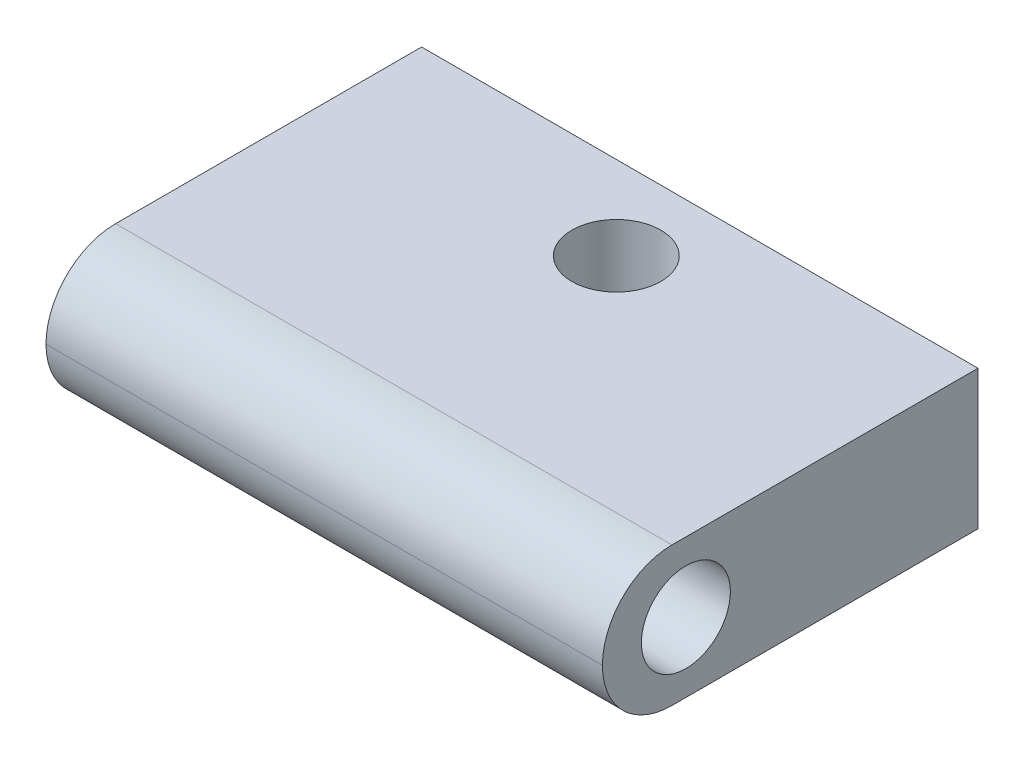
ISO-10303-21;
HEADER;
FILE_DESCRIPTION(('STEP AP214'),'2;1');
FILE_NAME('part.step','',(''),(''),'','','');
FILE_SCHEMA(('AUTOMOTIVE_DESIGN { 1 0 10303 214 1 1 1 1 }'));
ENDSEC;
DATA;
#1=APPLICATION_CONTEXT('core data for automotive mechanical design processes');
#2=APPLICATION_PROTOCOL_DEFINITION('international standard','automotive_design',2000,#1);
#3=PRODUCT_CONTEXT('',#1,'mechanical');
#4=PRODUCT('Part','Part','',(#3));
#5=PRODUCT_RELATED_PRODUCT_CATEGORY('part','',(#4));
#6=PRODUCT_DEFINITION_FORMATION('','',#4);
#7=PRODUCT_DEFINITION_CONTEXT('part definition',#1,'design');
#8=PRODUCT_DEFINITION('design','',#6,#7);
#9=PRODUCT_DEFINITION_SHAPE('','',#8);
#10=(LENGTH_UNIT() NAMED_UNIT(*) SI_UNIT(.MILLI.,.METRE.));
#11=(NAMED_UNIT(*) PLANE_ANGLE_UNIT() SI_UNIT($,.RADIAN.));
#12=(NAMED_UNIT(*) SI_UNIT($,.STERADIAN.) SOLID_ANGLE_UNIT());
#13=UNCERTAINTY_MEASURE_WITH_UNIT(LENGTH_MEASURE(1.E-05),#10,'distance_accuracy_value','');
#14=(GEOMETRIC_REPRESENTATION_CONTEXT(3) GLOBAL_UNCERTAINTY_ASSIGNED_CONTEXT((#13)) GLOBAL_UNIT_ASSIGNED_CONTEXT((#10,
#11,#12)) REPRESENTATION_CONTEXT('',''));
#15=CARTESIAN_POINT('',(0.,0.,0.));
#16=DIRECTION('',(0.,0.,1.));
#17=DIRECTION('',(1.,0.,0.));
#18=AXIS2_PLACEMENT_3D('',#15,#16,#17);
#19=CARTESIAN_POINT('',(10.,5.,-6.75));
#20=DIRECTION('',(0.,0.,1.));
#21=DIRECTION('',(1.,0.,0.));
#22=AXIS2_PLACEMENT_3D('',#19,#20,#21);
#23=PLANE('',#22);
#24=DIRECTION('',(-1.,0.,0.));
#25=VECTOR('',#24,1.);
#26=CARTESIAN_POINT('',(10.,0.,-6.75));
#27=LINE('',#26,#25);
#28=CARTESIAN_POINT('',(10.,0.,-6.75));
#29=VERTEX_POINT('',#28);
#30=CARTESIAN_POINT('',(-10.,0.,-6.75));
#31=VERTEX_POINT('',#30);
#32=EDGE_CURVE('E109',#29,#31,#27,.T.);
#33=ORIENTED_EDGE('',*,*,#32,.T.);
#34=DIRECTION('',(0.,-1.,0.));
#35=VECTOR('',#34,1.);
#36=CARTESIAN_POINT('',(-10.,5.,-6.75));
#37=LINE('',#36,#35);
#38=CARTESIAN_POINT('',(-10.,5.,-6.75));
#39=VERTEX_POINT('',#38);
#40=EDGE_CURVE('E91',#39,#31,#37,.T.);
#41=ORIENTED_EDGE('',*,*,#40,.F.);
#42=DIRECTION('',(-1.,0.,0.));
#43=VECTOR('',#42,1.);
#44=CARTESIAN_POINT('',(10.,5.,-6.75));
#45=LINE('',#44,#43);
#46=CARTESIAN_POINT('',(10.,5.,-6.75));
#47=VERTEX_POINT('',#46);
#48=EDGE_CURVE('E97',#47,#39,#45,.T.);
#49=ORIENTED_EDGE('',*,*,#48,.F.);
#50=DIRECTION('',(0.,-1.,0.));
#51=VECTOR('',#50,1.);
#52=CARTESIAN_POINT('',(10.,5.,-6.75));
#53=LINE('',#52,#51);
#54=EDGE_CURVE('E112',#47,#29,#53,.T.);
#55=ORIENTED_EDGE('',*,*,#54,.T.);
#56=EDGE_LOOP('',(#33,#41,#49,#55));
#57=FACE_BOUND('',#56,.T.);
#58=ADVANCED_FACE('F44',(#57),#23,.F.);
#59=CARTESIAN_POINT('',(-10.,5.,-6.75));
#60=DIRECTION('',(1.,0.,0.));
#61=DIRECTION('',(0.,0.,-1.));
#62=AXIS2_PLACEMENT_3D('',#59,#60,#61);
#63=PLANE('',#62);
#64=CARTESIAN_POINT('',(-10.,2.5,3.75));
#65=DIRECTION('',(1.,0.,0.));
#66=DIRECTION('',(0.,0.,-1.));
#67=AXIS2_PLACEMENT_3D('',#64,#65,#66);
#68=CIRCLE('',#67,1.6);
#69=CARTESIAN_POINT('',(-10.,2.5,2.15));
#70=VERTEX_POINT('',#69);
#71=EDGE_CURVE('E153',#70,#70,#68,.T.);
#72=ORIENTED_EDGE('',*,*,#71,.T.);
#73=EDGE_LOOP('',(#72));
#74=FACE_BOUND('',#73,.T.);
#75=DIRECTION('',(0.,0.,1.));
#76=VECTOR('',#75,1.);
#77=CARTESIAN_POINT('',(-10.,0.,-6.75));
#78=LINE('',#77,#76);
#79=CARTESIAN_POINT('',(-10.,0.,4.25));
#80=VERTEX_POINT('',#79);
#81=EDGE_CURVE('E134',#31,#80,#78,.T.);
#82=ORIENTED_EDGE('',*,*,#81,.T.);
#83=CARTESIAN_POINT('',(-10.,2.5,4.25));
#84=DIRECTION('',(1.,0.,0.));
#85=DIRECTION('',(0.,0.,-1.));
#86=AXIS2_PLACEMENT_3D('',#83,#84,#85);
#87=CIRCLE('',#86,2.5);
#88=CARTESIAN_POINT('',(-10.,2.5,6.75));
#89=VERTEX_POINT('',#88);
#90=EDGE_CURVE('E54',#80,#89,#87,.F.);
#91=ORIENTED_EDGE('',*,*,#90,.T.);
#92=CARTESIAN_POINT('',(-10.,2.5,4.25));
#93=DIRECTION('',(1.,0.,0.));
#94=DIRECTION('',(0.,0.,-1.));
#95=AXIS2_PLACEMENT_3D('',#92,#93,#94);
#96=CIRCLE('',#95,2.5);
#97=CARTESIAN_POINT('',(-10.,5.,4.25));
#98=VERTEX_POINT('',#97);
#99=EDGE_CURVE('E61',#89,#98,#96,.F.);
#100=ORIENTED_EDGE('',*,*,#99,.T.);
#101=DIRECTION('',(0.,0.,1.));
#102=VECTOR('',#101,1.);
#103=CARTESIAN_POINT('',(-10.,5.,-6.75));
#104=LINE('',#103,#102);
#105=EDGE_CURVE('E87',#39,#98,#104,.T.);
#106=ORIENTED_EDGE('',*,*,#105,.F.);
#107=ORIENTED_EDGE('',*,*,#40,.T.);
#108=EDGE_LOOP('',(#82,#91,#100,#106,#107));
#109=FACE_BOUND('',#108,.T.);
#110=ADVANCED_FACE('F89',(#74,#109),#63,.F.);
#111=CARTESIAN_POINT('',(10.,5.,-6.75));
#112=DIRECTION('',(-1.,0.,0.));
#113=DIRECTION('',(0.,0.,1.));
#114=AXIS2_PLACEMENT_3D('',#111,#112,#113);
#115=PLANE('',#114);
#116=CARTESIAN_POINT('',(10.,2.5,3.75));
#117=DIRECTION('',(1.,0.,0.));
#118=DIRECTION('',(0.,0.,-1.));
#119=AXIS2_PLACEMENT_3D('',#116,#117,#118);
#120=CIRCLE('',#119,1.6);
#121=CARTESIAN_POINT('',(10.,2.5,2.15));
#122=VERTEX_POINT('',#121);
#123=EDGE_CURVE('E157',#122,#122,#120,.T.);
#124=ORIENTED_EDGE('',*,*,#123,.F.);
#125=EDGE_LOOP('',(#124));
#126=FACE_BOUND('',#125,.T.);
#127=CARTESIAN_POINT('',(10.,2.5,4.25));
#128=DIRECTION('',(-1.,0.,0.));
#129=DIRECTION('',(0.,0.,1.));
#130=AXIS2_PLACEMENT_3D('',#127,#128,#129);
#131=CIRCLE('',#130,2.5);
#132=CARTESIAN_POINT('',(10.,5.,4.25));
#133=VERTEX_POINT('',#132);
#134=CARTESIAN_POINT('',(10.,2.5,6.75));
#135=VERTEX_POINT('',#134);
#136=EDGE_CURVE('E111',#133,#135,#131,.F.);
#137=ORIENTED_EDGE('',*,*,#136,.T.);
#138=CARTESIAN_POINT('',(10.,2.5,4.25));
#139=DIRECTION('',(-1.,0.,0.));
#140=DIRECTION('',(0.,0.,1.));
#141=AXIS2_PLACEMENT_3D('',#138,#139,#140);
#142=CIRCLE('',#141,2.5);
#143=CARTESIAN_POINT('',(10.,0.,4.25));
#144=VERTEX_POINT('',#143);
#145=EDGE_CURVE('E116',#135,#144,#142,.F.);
#146=ORIENTED_EDGE('',*,*,#145,.T.);
#147=DIRECTION('',(0.,0.,-1.));
#148=VECTOR('',#147,1.);
#149=CARTESIAN_POINT('',(10.,0.,-6.75));
#150=LINE('',#149,#148);
#151=EDGE_CURVE('E106',#144,#29,#150,.T.);
#152=ORIENTED_EDGE('',*,*,#151,.T.);
#153=ORIENTED_EDGE('',*,*,#54,.F.);
#154=DIRECTION('',(0.,0.,-1.));
#155=VECTOR('',#154,1.);
#156=CARTESIAN_POINT('',(10.,5.,-6.75));
#157=LINE('',#156,#155);
#158=EDGE_CURVE('E96',#133,#47,#157,.T.);
#159=ORIENTED_EDGE('',*,*,#158,.F.);
#160=EDGE_LOOP('',(#137,#146,#152,#153,#159));
#161=FACE_BOUND('',#160,.T.);
#162=ADVANCED_FACE('F164',(#126,#161),#115,.F.);
#163=CARTESIAN_POINT('',(0.,5.,0.));
#164=DIRECTION('',(0.,1.,0.));
#165=DIRECTION('',(0.,0.,1.));
#166=AXIS2_PLACEMENT_3D('',#163,#164,#165);
#167=PLANE('',#166);
#168=CARTESIAN_POINT('',(0.,5.,-3.75));
#169=DIRECTION('',(0.,1.,0.));
#170=DIRECTION('',(0.,0.,1.));
#171=AXIS2_PLACEMENT_3D('',#168,#169,#170);
#172=CIRCLE('',#171,1.6);
#173=CARTESIAN_POINT('',(0.,5.,-2.15));
#174=VERTEX_POINT('',#173);
#175=EDGE_CURVE('E149',#174,#174,#172,.T.);
#176=ORIENTED_EDGE('',*,*,#175,.F.);
#177=EDGE_LOOP('',(#176));
#178=FACE_BOUND('',#177,.T.);
#179=ORIENTED_EDGE('',*,*,#105,.T.);
#180=DIRECTION('',(1.,0.,0.));
#181=VECTOR('',#180,1.);
#182=CARTESIAN_POINT('',(10.,5.,4.25));
#183=LINE('',#182,#181);
#184=EDGE_CURVE('E11',#98,#133,#183,.T.);
#185=ORIENTED_EDGE('',*,*,#184,.T.);
#186=ORIENTED_EDGE('',*,*,#158,.T.);
#187=ORIENTED_EDGE('',*,*,#48,.T.);
#188=EDGE_LOOP('',(#179,#185,#186,#187));
#189=FACE_BOUND('',#188,.T.);
#190=ADVANCED_FACE('F100',(#178,#189),#167,.T.);
#191=CARTESIAN_POINT('',(0.,0.,0.));
#192=DIRECTION('',(0.,1.,0.));
#193=DIRECTION('',(0.,0.,1.));
#194=AXIS2_PLACEMENT_3D('',#191,#192,#193);
#195=PLANE('',#194);
#196=CARTESIAN_POINT('',(0.,0.,-3.75));
#197=DIRECTION('',(0.,1.,0.));
#198=DIRECTION('',(0.,0.,1.));
#199=AXIS2_PLACEMENT_3D('',#196,#197,#198);
#200=CIRCLE('',#199,1.6);
#201=CARTESIAN_POINT('',(0.,0.,-2.15));
#202=VERTEX_POINT('',#201);
#203=EDGE_CURVE('E141',#202,#202,#200,.T.);
#204=ORIENTED_EDGE('',*,*,#203,.T.);
#205=EDGE_LOOP('',(#204));
#206=FACE_BOUND('',#205,.T.);
#207=ORIENTED_EDGE('',*,*,#151,.F.);
#208=DIRECTION('',(1.,0.,0.));
#209=VECTOR('',#208,1.);
#210=CARTESIAN_POINT('',(0.,0.,4.25));
#211=LINE('',#210,#209);
#212=EDGE_CURVE('E123',#144,#80,#211,.F.);
#213=ORIENTED_EDGE('',*,*,#212,.T.);
#214=ORIENTED_EDGE('',*,*,#81,.F.);
#215=ORIENTED_EDGE('',*,*,#32,.F.);
#216=EDGE_LOOP('',(#207,#213,#214,#215));
#217=FACE_BOUND('',#216,.T.);
#218=ADVANCED_FACE('F133',(#206,#217),#195,.F.);
#219=CARTESIAN_POINT('',(0.,5.,-3.75));
#220=DIRECTION('',(0.,1.,0.));
#221=DIRECTION('',(0.,0.,1.));
#222=AXIS2_PLACEMENT_3D('',#219,#220,#221);
#223=CYLINDRICAL_SURFACE('',#222,1.6);
#224=ORIENTED_EDGE('',*,*,#203,.F.);
#225=EDGE_LOOP('',(#224));
#226=FACE_BOUND('',#225,.T.);
#227=ORIENTED_EDGE('',*,*,#175,.T.);
#228=EDGE_LOOP('',(#227));
#229=FACE_BOUND('',#228,.T.);
#230=ADVANCED_FACE('F182',(#226,#229),#223,.F.);
#231=CARTESIAN_POINT('',(0.,2.5,4.25));
#232=DIRECTION('',(-1.,0.,0.));
#233=DIRECTION('',(0.,0.,1.));
#234=AXIS2_PLACEMENT_3D('',#231,#232,#233);
#235=CYLINDRICAL_SURFACE('',#234,2.5);
#236=ORIENTED_EDGE('',*,*,#184,.F.);
#237=ORIENTED_EDGE('',*,*,#99,.F.);
#238=DIRECTION('',(1.,0.,0.));
#239=VECTOR('',#238,1.);
#240=CARTESIAN_POINT('',(-10.,2.5,6.75));
#241=LINE('',#240,#239);
#242=EDGE_CURVE('E48',#135,#89,#241,.F.);
#243=ORIENTED_EDGE('',*,*,#242,.F.);
#244=ORIENTED_EDGE('',*,*,#136,.F.);
#245=EDGE_LOOP('',(#236,#237,#243,#244));
#246=FACE_BOUND('',#245,.T.);
#247=ADVANCED_FACE('F46',(#246),#235,.T.);
#248=CARTESIAN_POINT('',(-10.,2.5,4.25));
#249=DIRECTION('',(1.,0.,0.));
#250=DIRECTION('',(0.,0.,-1.));
#251=AXIS2_PLACEMENT_3D('',#248,#249,#250);
#252=CYLINDRICAL_SURFACE('',#251,2.5);
#253=ORIENTED_EDGE('',*,*,#90,.F.);
#254=ORIENTED_EDGE('',*,*,#212,.F.);
#255=ORIENTED_EDGE('',*,*,#145,.F.);
#256=ORIENTED_EDGE('',*,*,#242,.T.);
#257=EDGE_LOOP('',(#253,#254,#255,#256));
#258=FACE_BOUND('',#257,.T.);
#259=ADVANCED_FACE('F173',(#258),#252,.T.);
#260=CARTESIAN_POINT('',(10.,2.5,3.75));
#261=DIRECTION('',(1.,0.,0.));
#262=DIRECTION('',(0.,0.,-1.));
#263=AXIS2_PLACEMENT_3D('',#260,#261,#262);
#264=CYLINDRICAL_SURFACE('',#263,1.6);
#265=ORIENTED_EDGE('',*,*,#71,.F.);
#266=EDGE_LOOP('',(#265));
#267=FACE_BOUND('',#266,.T.);
#268=ORIENTED_EDGE('',*,*,#123,.T.);
#269=EDGE_LOOP('',(#268));
#270=FACE_BOUND('',#269,.T.);
#271=ADVANCED_FACE('F162',(#267,#270),#264,.F.);
#272=CLOSED_SHELL('',(#58,#110,#162,#190,#218,#230,#247,#259,#271));
#273=MANIFOLD_SOLID_BREP('B2',#272);
#274=ADVANCED_BREP_SHAPE_REPRESENTATION('',(#18,#273),#14);
#275=SHAPE_DEFINITION_REPRESENTATION(#9,#274);
ENDSEC;
END-ISO-10303-21;
